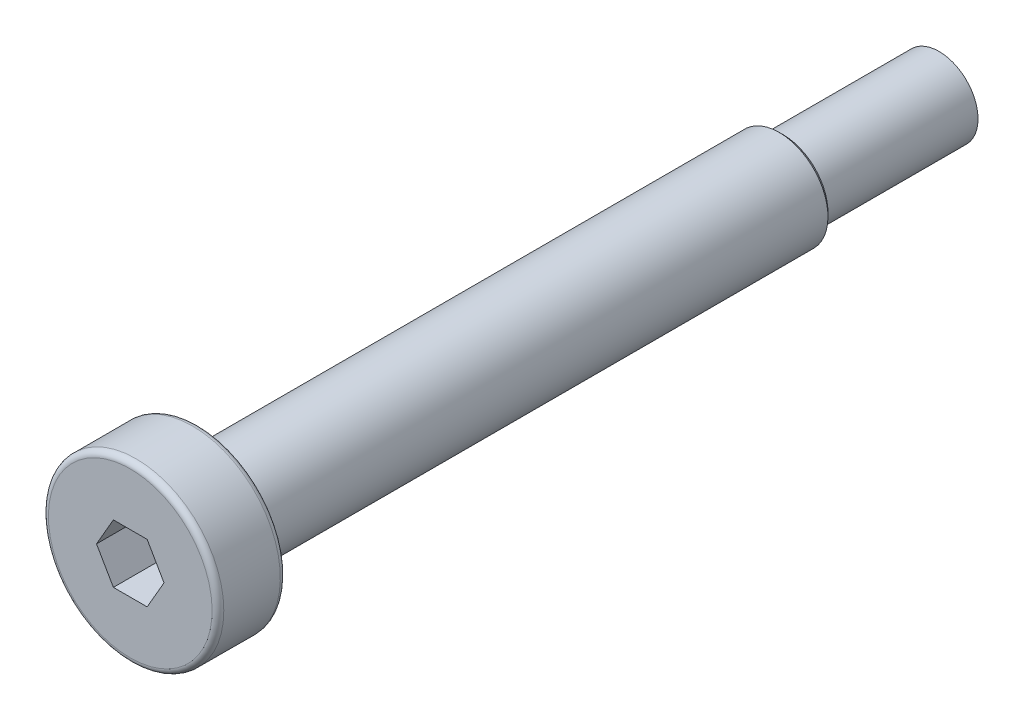
ISO-10303-21;
HEADER;
FILE_DESCRIPTION(('STEP AP214'),'2;1');
FILE_NAME('part.step','',(''),(''),'','','');
FILE_SCHEMA(('AUTOMOTIVE_DESIGN { 1 0 10303 214 1 1 1 1 }'));
ENDSEC;
DATA;
#1=APPLICATION_CONTEXT('core data for automotive mechanical design processes');
#2=APPLICATION_PROTOCOL_DEFINITION('international standard','automotive_design',2000,#1);
#3=PRODUCT_CONTEXT('',#1,'mechanical');
#4=PRODUCT('Part','Part','',(#3));
#5=PRODUCT_RELATED_PRODUCT_CATEGORY('part','',(#4));
#6=PRODUCT_DEFINITION_FORMATION('','',#4);
#7=PRODUCT_DEFINITION_CONTEXT('part definition',#1,'design');
#8=PRODUCT_DEFINITION('design','',#6,#7);
#9=PRODUCT_DEFINITION_SHAPE('','',#8);
#10=(LENGTH_UNIT() NAMED_UNIT(*) SI_UNIT(.MILLI.,.METRE.));
#11=(NAMED_UNIT(*) PLANE_ANGLE_UNIT() SI_UNIT($,.RADIAN.));
#12=(NAMED_UNIT(*) SI_UNIT($,.STERADIAN.) SOLID_ANGLE_UNIT());
#13=UNCERTAINTY_MEASURE_WITH_UNIT(LENGTH_MEASURE(1.E-05),#10,'distance_accuracy_value','');
#14=(GEOMETRIC_REPRESENTATION_CONTEXT(3) GLOBAL_UNCERTAINTY_ASSIGNED_CONTEXT((#13)) GLOBAL_UNIT_ASSIGNED_CONTEXT((#10,
#11,#12)) REPRESENTATION_CONTEXT('',''));
#15=CARTESIAN_POINT('',(0.,0.,0.));
#16=DIRECTION('',(0.,0.,1.));
#17=DIRECTION('',(1.,0.,0.));
#18=AXIS2_PLACEMENT_3D('',#15,#16,#17);
#19=CARTESIAN_POINT('',(0.,0.,0.));
#20=DIRECTION('',(0.,0.,-1.));
#21=DIRECTION('',(0.,1.,0.));
#22=AXIS2_PLACEMENT_3D('',#19,#20,#21);
#23=PLANE('',#22);
#24=CARTESIAN_POINT('',(0.,0.,0.));
#25=DIRECTION('',(0.,0.,-1.));
#26=DIRECTION('',(0.,1.,0.));
#27=AXIS2_PLACEMENT_3D('',#24,#25,#26);
#28=CIRCLE('',#27,2.);
#29=CARTESIAN_POINT('',(0.,2.,0.));
#30=VERTEX_POINT('',#29);
#31=EDGE_CURVE('E153',#30,#30,#28,.T.);
#32=ORIENTED_EDGE('',*,*,#31,.T.);
#33=EDGE_LOOP('',(#32));
#34=FACE_BOUND('',#33,.T.);
#35=ADVANCED_FACE('F39',(#34),#23,.T.);
#36=CARTESIAN_POINT('',(0.,0.,0.));
#37=DIRECTION('',(0.,0.,-1.));
#38=DIRECTION('',(0.,1.,0.));
#39=AXIS2_PLACEMENT_3D('',#36,#37,#38);
#40=CYLINDRICAL_SURFACE('',#39,2.);
#41=CARTESIAN_POINT('',(0.,0.,8.));
#42=DIRECTION('',(0.,0.,-1.));
#43=DIRECTION('',(0.,1.,0.));
#44=AXIS2_PLACEMENT_3D('',#41,#42,#43);
#45=CIRCLE('',#44,2.);
#46=CARTESIAN_POINT('',(0.,2.,8.));
#47=VERTEX_POINT('',#46);
#48=EDGE_CURVE('E150',#47,#47,#45,.T.);
#49=ORIENTED_EDGE('',*,*,#48,.T.);
#50=EDGE_LOOP('',(#49));
#51=FACE_BOUND('',#50,.T.);
#52=ORIENTED_EDGE('',*,*,#31,.F.);
#53=EDGE_LOOP('',(#52));
#54=FACE_BOUND('',#53,.T.);
#55=ADVANCED_FACE('F182',(#51,#54),#40,.T.);
#56=CARTESIAN_POINT('',(0.,2.,8.));
#57=DIRECTION('',(0.,0.,-1.));
#58=DIRECTION('',(0.,1.,0.));
#59=AXIS2_PLACEMENT_3D('',#56,#57,#58);
#60=PLANE('',#59);
#61=CARTESIAN_POINT('',(0.,0.,8.));
#62=DIRECTION('',(0.,0.,-1.));
#63=DIRECTION('',(0.,1.,0.));
#64=AXIS2_PLACEMENT_3D('',#61,#62,#63);
#65=CIRCLE('',#64,2.30000000000001);
#66=CARTESIAN_POINT('',(0.,2.30000000000001,8.));
#67=VERTEX_POINT('',#66);
#68=EDGE_CURVE('E48',#67,#67,#65,.T.);
#69=ORIENTED_EDGE('',*,*,#68,.T.);
#70=EDGE_LOOP('',(#69));
#71=FACE_BOUND('',#70,.T.);
#72=ORIENTED_EDGE('',*,*,#48,.F.);
#73=EDGE_LOOP('',(#72));
#74=FACE_BOUND('',#73,.T.);
#75=ADVANCED_FACE('F170',(#71,#74),#60,.T.);
#76=CARTESIAN_POINT('',(0.,0.,0.));
#77=DIRECTION('',(0.,0.,-1.));
#78=DIRECTION('',(0.,1.,0.));
#79=AXIS2_PLACEMENT_3D('',#76,#77,#78);
#80=CYLINDRICAL_SURFACE('',#79,2.5);
#81=CARTESIAN_POINT('',(0.,0.,8.19999999999999));
#82=DIRECTION('',(0.,0.,-1.));
#83=DIRECTION('',(0.,1.,0.));
#84=AXIS2_PLACEMENT_3D('',#81,#82,#83);
#85=CIRCLE('',#84,2.5);
#86=CARTESIAN_POINT('',(0.,2.5,8.19999999999999));
#87=VERTEX_POINT('',#86);
#88=EDGE_CURVE('E11',#87,#87,#85,.F.);
#89=ORIENTED_EDGE('',*,*,#88,.T.);
#90=EDGE_LOOP('',(#89));
#91=FACE_BOUND('',#90,.T.);
#92=CARTESIAN_POINT('',(0.,0.,38.));
#93=DIRECTION('',(0.,0.,-1.));
#94=DIRECTION('',(0.,1.,0.));
#95=AXIS2_PLACEMENT_3D('',#92,#93,#94);
#96=CIRCLE('',#95,2.5);
#97=CARTESIAN_POINT('',(0.,2.5,38.));
#98=VERTEX_POINT('',#97);
#99=EDGE_CURVE('E142',#98,#98,#96,.T.);
#100=ORIENTED_EDGE('',*,*,#99,.T.);
#101=EDGE_LOOP('',(#100));
#102=FACE_BOUND('',#101,.T.);
#103=ADVANCED_FACE('F220',(#91,#102),#80,.T.);
#104=CARTESIAN_POINT('',(0.,2.5,38.));
#105=DIRECTION('',(0.,0.,-1.));
#106=DIRECTION('',(0.,1.,0.));
#107=AXIS2_PLACEMENT_3D('',#104,#105,#106);
#108=PLANE('',#107);
#109=CARTESIAN_POINT('',(0.,0.,38.));
#110=DIRECTION('',(0.,0.,-1.));
#111=DIRECTION('',(0.,1.,0.));
#112=AXIS2_PLACEMENT_3D('',#109,#110,#111);
#113=CIRCLE('',#112,4.2);
#114=CARTESIAN_POINT('',(0.,4.2,38.));
#115=VERTEX_POINT('',#114);
#116=EDGE_CURVE('E156',#115,#115,#113,.T.);
#117=ORIENTED_EDGE('',*,*,#116,.T.);
#118=EDGE_LOOP('',(#117));
#119=FACE_BOUND('',#118,.T.);
#120=ORIENTED_EDGE('',*,*,#99,.F.);
#121=EDGE_LOOP('',(#120));
#122=FACE_BOUND('',#121,.T.);
#123=ADVANCED_FACE('F211',(#119,#122),#108,.T.);
#124=CARTESIAN_POINT('',(0.,0.,0.));
#125=DIRECTION('',(0.,0.,-1.));
#126=DIRECTION('',(0.,1.,0.));
#127=AXIS2_PLACEMENT_3D('',#124,#125,#126);
#128=CYLINDRICAL_SURFACE('',#127,4.5);
#129=CARTESIAN_POINT('',(0.,0.,38.3));
#130=DIRECTION('',(0.,0.,-1.));
#131=DIRECTION('',(0.,1.,0.));
#132=AXIS2_PLACEMENT_3D('',#129,#130,#131);
#133=CIRCLE('',#132,4.5);
#134=CARTESIAN_POINT('',(0.,4.5,38.3));
#135=VERTEX_POINT('',#134);
#136=EDGE_CURVE('E162',#135,#135,#133,.F.);
#137=ORIENTED_EDGE('',*,*,#136,.T.);
#138=EDGE_LOOP('',(#137));
#139=FACE_BOUND('',#138,.T.);
#140=CARTESIAN_POINT('',(0.,0.,41.2));
#141=DIRECTION('',(0.,0.,1.));
#142=DIRECTION('',(0.,-1.,0.));
#143=AXIS2_PLACEMENT_3D('',#140,#141,#142);
#144=CIRCLE('',#143,4.5);
#145=CARTESIAN_POINT('',(0.,-4.50000000000001,41.2));
#146=VERTEX_POINT('',#145);
#147=EDGE_CURVE('E159',#146,#146,#144,.F.);
#148=ORIENTED_EDGE('',*,*,#147,.T.);
#149=EDGE_LOOP('',(#148));
#150=FACE_BOUND('',#149,.T.);
#151=ADVANCED_FACE('F209',(#139,#150),#128,.T.);
#152=CARTESIAN_POINT('',(0.,4.5,41.5));
#153=DIRECTION('',(0.,0.,1.));
#154=DIRECTION('',(0.,-1.,0.));
#155=AXIS2_PLACEMENT_3D('',#152,#153,#154);
#156=PLANE('',#155);
#157=DIRECTION('',(0.5,0.866025403784439,0.));
#158=VECTOR('',#157,1.);
#159=CARTESIAN_POINT('',(0.866025403784438,-1.5,41.5));
#160=LINE('',#159,#158);
#161=CARTESIAN_POINT('',(0.866025403784438,-1.5,41.5));
#162=VERTEX_POINT('',#161);
#163=CARTESIAN_POINT('',(1.73205080756888,0.,41.5));
#164=VERTEX_POINT('',#163);
#165=EDGE_CURVE('E55',#162,#164,#160,.T.);
#166=ORIENTED_EDGE('',*,*,#165,.F.);
#167=DIRECTION('',(1.,0.,0.));
#168=VECTOR('',#167,1.);
#169=CARTESIAN_POINT('',(-0.866025403784439,-1.5,41.5));
#170=LINE('',#169,#168);
#171=CARTESIAN_POINT('',(-0.866025403784439,-1.5,41.5));
#172=VERTEX_POINT('',#171);
#173=EDGE_CURVE('E138',#172,#162,#170,.T.);
#174=ORIENTED_EDGE('',*,*,#173,.F.);
#175=DIRECTION('',(0.5,-0.866025403784439,0.));
#176=VECTOR('',#175,1.);
#177=CARTESIAN_POINT('',(-1.73205080756888,0.,41.5));
#178=LINE('',#177,#176);
#179=CARTESIAN_POINT('',(-1.73205080756888,0.,41.5));
#180=VERTEX_POINT('',#179);
#181=EDGE_CURVE('E136',#180,#172,#178,.T.);
#182=ORIENTED_EDGE('',*,*,#181,.F.);
#183=DIRECTION('',(-0.5,-0.866025403784439,0.));
#184=VECTOR('',#183,1.);
#185=CARTESIAN_POINT('',(-0.866025403784439,1.5,41.5));
#186=LINE('',#185,#184);
#187=CARTESIAN_POINT('',(-0.866025403784439,1.5,41.5));
#188=VERTEX_POINT('',#187);
#189=EDGE_CURVE('E103',#188,#180,#186,.T.);
#190=ORIENTED_EDGE('',*,*,#189,.F.);
#191=DIRECTION('',(-1.,0.,0.));
#192=VECTOR('',#191,1.);
#193=CARTESIAN_POINT('',(0.866025403784437,1.5,41.5));
#194=LINE('',#193,#192);
#195=CARTESIAN_POINT('',(0.866025403784437,1.5,41.5));
#196=VERTEX_POINT('',#195);
#197=EDGE_CURVE('E132',#196,#188,#194,.T.);
#198=ORIENTED_EDGE('',*,*,#197,.F.);
#199=DIRECTION('',(-0.5,0.866025403784439,0.));
#200=VECTOR('',#199,1.);
#201=CARTESIAN_POINT('',(1.73205080756888,0.,41.5));
#202=LINE('',#201,#200);
#203=EDGE_CURVE('E129',#164,#196,#202,.T.);
#204=ORIENTED_EDGE('',*,*,#203,.F.);
#205=EDGE_LOOP('',(#166,#174,#182,#190,#198,#204));
#206=FACE_BOUND('',#205,.T.);
#207=CARTESIAN_POINT('',(0.,0.,41.5));
#208=DIRECTION('',(0.,0.,1.));
#209=DIRECTION('',(0.,-1.,0.));
#210=AXIS2_PLACEMENT_3D('',#207,#208,#209);
#211=CIRCLE('',#210,4.2);
#212=CARTESIAN_POINT('',(0.,-4.20000000000001,41.5));
#213=VERTEX_POINT('',#212);
#214=EDGE_CURVE('E165',#213,#213,#211,.T.);
#215=ORIENTED_EDGE('',*,*,#214,.T.);
#216=EDGE_LOOP('',(#215));
#217=FACE_BOUND('',#216,.T.);
#218=ADVANCED_FACE('F195',(#206,#217),#156,.T.);
#219=CARTESIAN_POINT('',(0.,0.,38.3));
#220=DIRECTION('',(0.,0.,-1.));
#221=DIRECTION('',(0.,1.,0.));
#222=AXIS2_PLACEMENT_3D('',#219,#220,#221);
#223=TOROIDAL_SURFACE('',#222,4.2,0.3);
#224=ORIENTED_EDGE('',*,*,#136,.F.);
#225=EDGE_LOOP('',(#224));
#226=FACE_BOUND('',#225,.T.);
#227=ORIENTED_EDGE('',*,*,#116,.F.);
#228=EDGE_LOOP('',(#227));
#229=FACE_BOUND('',#228,.T.);
#230=ADVANCED_FACE('F192',(#226,#229),#223,.T.);
#231=CARTESIAN_POINT('',(0.,0.,41.2));
#232=DIRECTION('',(0.,0.,1.));
#233=DIRECTION('',(0.,-1.,0.));
#234=AXIS2_PLACEMENT_3D('',#231,#232,#233);
#235=TOROIDAL_SURFACE('',#234,4.2,0.3);
#236=ORIENTED_EDGE('',*,*,#214,.F.);
#237=EDGE_LOOP('',(#236));
#238=FACE_BOUND('',#237,.T.);
#239=ORIENTED_EDGE('',*,*,#147,.F.);
#240=EDGE_LOOP('',(#239));
#241=FACE_BOUND('',#240,.T.);
#242=ADVANCED_FACE('F194',(#238,#241),#235,.T.);
#243=CARTESIAN_POINT('',(0.866025403784438,-1.5,39.1));
#244=DIRECTION('',(0.866025403784439,-0.5,0.));
#245=DIRECTION('',(0.5,0.866025403784439,0.));
#246=AXIS2_PLACEMENT_3D('',#243,#244,#245);
#247=PLANE('',#246);
#248=ORIENTED_EDGE('',*,*,#165,.T.);
#249=DIRECTION('',(0.,0.,1.));
#250=VECTOR('',#249,1.);
#251=CARTESIAN_POINT('',(1.73205080756888,0.,39.1));
#252=LINE('',#251,#250);
#253=CARTESIAN_POINT('',(1.73205080756888,0.,39.1));
#254=VERTEX_POINT('',#253);
#255=EDGE_CURVE('E85',#254,#164,#252,.T.);
#256=ORIENTED_EDGE('',*,*,#255,.F.);
#257=DIRECTION('',(0.5,0.866025403784439,0.));
#258=VECTOR('',#257,1.);
#259=CARTESIAN_POINT('',(0.866025403784438,-1.5,39.1));
#260=LINE('',#259,#258);
#261=CARTESIAN_POINT('',(0.866025403784438,-1.5,39.1));
#262=VERTEX_POINT('',#261);
#263=EDGE_CURVE('E140',#262,#254,#260,.T.);
#264=ORIENTED_EDGE('',*,*,#263,.F.);
#265=DIRECTION('',(0.,0.,1.));
#266=VECTOR('',#265,1.);
#267=CARTESIAN_POINT('',(0.866025403784438,-1.5,39.1));
#268=LINE('',#267,#266);
#269=EDGE_CURVE('E63',#262,#162,#268,.T.);
#270=ORIENTED_EDGE('',*,*,#269,.T.);
#271=EDGE_LOOP('',(#248,#256,#264,#270));
#272=FACE_BOUND('',#271,.T.);
#273=ADVANCED_FACE('F198',(#272),#247,.F.);
#274=CARTESIAN_POINT('',(-0.866025403784439,-1.5,39.1));
#275=DIRECTION('',(0.,-1.,0.));
#276=DIRECTION('',(1.,0.,0.));
#277=AXIS2_PLACEMENT_3D('',#274,#275,#276);
#278=PLANE('',#277);
#279=ORIENTED_EDGE('',*,*,#173,.T.);
#280=ORIENTED_EDGE('',*,*,#269,.F.);
#281=DIRECTION('',(1.,0.,0.));
#282=VECTOR('',#281,1.);
#283=CARTESIAN_POINT('',(-0.866025403784439,-1.5,39.1));
#284=LINE('',#283,#282);
#285=CARTESIAN_POINT('',(-0.866025403784439,-1.5,39.1));
#286=VERTEX_POINT('',#285);
#287=EDGE_CURVE('E115',#286,#262,#284,.T.);
#288=ORIENTED_EDGE('',*,*,#287,.F.);
#289=DIRECTION('',(0.,0.,1.));
#290=VECTOR('',#289,1.);
#291=CARTESIAN_POINT('',(-0.866025403784439,-1.5,39.1));
#292=LINE('',#291,#290);
#293=EDGE_CURVE('E107',#286,#172,#292,.T.);
#294=ORIENTED_EDGE('',*,*,#293,.T.);
#295=EDGE_LOOP('',(#279,#280,#288,#294));
#296=FACE_BOUND('',#295,.T.);
#297=ADVANCED_FACE('F203',(#296),#278,.F.);
#298=CARTESIAN_POINT('',(-1.73205080756888,0.,39.1));
#299=DIRECTION('',(-0.866025403784439,-0.5,0.));
#300=DIRECTION('',(0.5,-0.866025403784439,0.));
#301=AXIS2_PLACEMENT_3D('',#298,#299,#300);
#302=PLANE('',#301);
#303=ORIENTED_EDGE('',*,*,#181,.T.);
#304=ORIENTED_EDGE('',*,*,#293,.F.);
#305=DIRECTION('',(0.5,-0.866025403784439,0.));
#306=VECTOR('',#305,1.);
#307=CARTESIAN_POINT('',(-1.73205080756888,0.,39.1));
#308=LINE('',#307,#306);
#309=CARTESIAN_POINT('',(-1.73205080756888,0.,39.1));
#310=VERTEX_POINT('',#309);
#311=EDGE_CURVE('E111',#310,#286,#308,.T.);
#312=ORIENTED_EDGE('',*,*,#311,.F.);
#313=DIRECTION('',(0.,0.,1.));
#314=VECTOR('',#313,1.);
#315=CARTESIAN_POINT('',(-1.73205080756888,0.,39.1));
#316=LINE('',#315,#314);
#317=EDGE_CURVE('E96',#310,#180,#316,.T.);
#318=ORIENTED_EDGE('',*,*,#317,.T.);
#319=EDGE_LOOP('',(#303,#304,#312,#318));
#320=FACE_BOUND('',#319,.T.);
#321=ADVANCED_FACE('F112',(#320),#302,.F.);
#322=CARTESIAN_POINT('',(-0.866025403784439,1.5,39.1));
#323=DIRECTION('',(-0.866025403784439,0.5,0.));
#324=DIRECTION('',(-0.5,-0.866025403784439,0.));
#325=AXIS2_PLACEMENT_3D('',#322,#323,#324);
#326=PLANE('',#325);
#327=ORIENTED_EDGE('',*,*,#189,.T.);
#328=ORIENTED_EDGE('',*,*,#317,.F.);
#329=DIRECTION('',(-0.5,-0.866025403784439,0.));
#330=VECTOR('',#329,1.);
#331=CARTESIAN_POINT('',(-0.866025403784439,1.5,39.1));
#332=LINE('',#331,#330);
#333=CARTESIAN_POINT('',(-0.866025403784439,1.5,39.1));
#334=VERTEX_POINT('',#333);
#335=EDGE_CURVE('E100',#334,#310,#332,.T.);
#336=ORIENTED_EDGE('',*,*,#335,.F.);
#337=DIRECTION('',(0.,0.,1.));
#338=VECTOR('',#337,1.);
#339=CARTESIAN_POINT('',(-0.866025403784439,1.5,39.1));
#340=LINE('',#339,#338);
#341=EDGE_CURVE('E108',#334,#188,#340,.T.);
#342=ORIENTED_EDGE('',*,*,#341,.T.);
#343=EDGE_LOOP('',(#327,#328,#336,#342));
#344=FACE_BOUND('',#343,.T.);
#345=ADVANCED_FACE('F98',(#344),#326,.F.);
#346=CARTESIAN_POINT('',(0.866025403784437,1.5,39.1));
#347=DIRECTION('',(0.,1.,0.));
#348=DIRECTION('',(-1.,0.,0.));
#349=AXIS2_PLACEMENT_3D('',#346,#347,#348);
#350=PLANE('',#349);
#351=ORIENTED_EDGE('',*,*,#197,.T.);
#352=ORIENTED_EDGE('',*,*,#341,.F.);
#353=DIRECTION('',(-1.,0.,0.));
#354=VECTOR('',#353,1.);
#355=CARTESIAN_POINT('',(0.866025403784437,1.5,39.1));
#356=LINE('',#355,#354);
#357=CARTESIAN_POINT('',(0.866025403784437,1.5,39.1));
#358=VERTEX_POINT('',#357);
#359=EDGE_CURVE('E121',#358,#334,#356,.T.);
#360=ORIENTED_EDGE('',*,*,#359,.F.);
#361=DIRECTION('',(0.,0.,1.));
#362=VECTOR('',#361,1.);
#363=CARTESIAN_POINT('',(0.866025403784437,1.5,39.1));
#364=LINE('',#363,#362);
#365=EDGE_CURVE('E145',#358,#196,#364,.T.);
#366=ORIENTED_EDGE('',*,*,#365,.T.);
#367=EDGE_LOOP('',(#351,#352,#360,#366));
#368=FACE_BOUND('',#367,.T.);
#369=ADVANCED_FACE('F294',(#368),#350,.F.);
#370=CARTESIAN_POINT('',(1.73205080756888,0.,39.1));
#371=DIRECTION('',(0.866025403784439,0.5,0.));
#372=DIRECTION('',(-0.5,0.866025403784439,0.));
#373=AXIS2_PLACEMENT_3D('',#370,#371,#372);
#374=PLANE('',#373);
#375=ORIENTED_EDGE('',*,*,#203,.T.);
#376=ORIENTED_EDGE('',*,*,#365,.F.);
#377=DIRECTION('',(-0.5,0.866025403784439,0.));
#378=VECTOR('',#377,1.);
#379=CARTESIAN_POINT('',(1.73205080756888,0.,39.1));
#380=LINE('',#379,#378);
#381=EDGE_CURVE('E123',#254,#358,#380,.T.);
#382=ORIENTED_EDGE('',*,*,#381,.F.);
#383=ORIENTED_EDGE('',*,*,#255,.T.);
#384=EDGE_LOOP('',(#375,#376,#382,#383));
#385=FACE_BOUND('',#384,.T.);
#386=ADVANCED_FACE('F178',(#385),#374,.F.);
#387=CARTESIAN_POINT('',(0.,0.,39.1));
#388=DIRECTION('',(0.,0.,1.));
#389=DIRECTION('',(1.,0.,0.));
#390=AXIS2_PLACEMENT_3D('',#387,#388,#389);
#391=PLANE('',#390);
#392=ORIENTED_EDGE('',*,*,#263,.T.);
#393=ORIENTED_EDGE('',*,*,#381,.T.);
#394=ORIENTED_EDGE('',*,*,#359,.T.);
#395=ORIENTED_EDGE('',*,*,#335,.T.);
#396=ORIENTED_EDGE('',*,*,#311,.T.);
#397=ORIENTED_EDGE('',*,*,#287,.T.);
#398=EDGE_LOOP('',(#392,#393,#394,#395,#396,#397));
#399=FACE_BOUND('',#398,.T.);
#400=ADVANCED_FACE('F118',(#399),#391,.T.);
#401=CARTESIAN_POINT('',(0.,0.,8.));
#402=DIRECTION('',(0.,0.,1.));
#403=DIRECTION('',(0.,-1.,0.));
#404=AXIS2_PLACEMENT_3D('',#401,#402,#403);
#405=CONICAL_SURFACE('',#404,2.30000000000001,0.785398163397441);
#406=ORIENTED_EDGE('',*,*,#88,.F.);
#407=EDGE_LOOP('',(#406));
#408=FACE_BOUND('',#407,.T.);
#409=ORIENTED_EDGE('',*,*,#68,.F.);
#410=EDGE_LOOP('',(#409));
#411=FACE_BOUND('',#410,.T.);
#412=ADVANCED_FACE('F42',(#408,#411),#405,.T.);
#413=CLOSED_SHELL('',(#35,#55,#75,#103,#123,#151,#218,#230,#242,#273,#297,#321,#345,#369,#386,
#400,#412));
#414=MANIFOLD_SOLID_BREP('B2',#413);
#415=ADVANCED_BREP_SHAPE_REPRESENTATION('',(#18,#414),#14);
#416=SHAPE_DEFINITION_REPRESENTATION(#9,#415);
ENDSEC;
END-ISO-10303-21;
